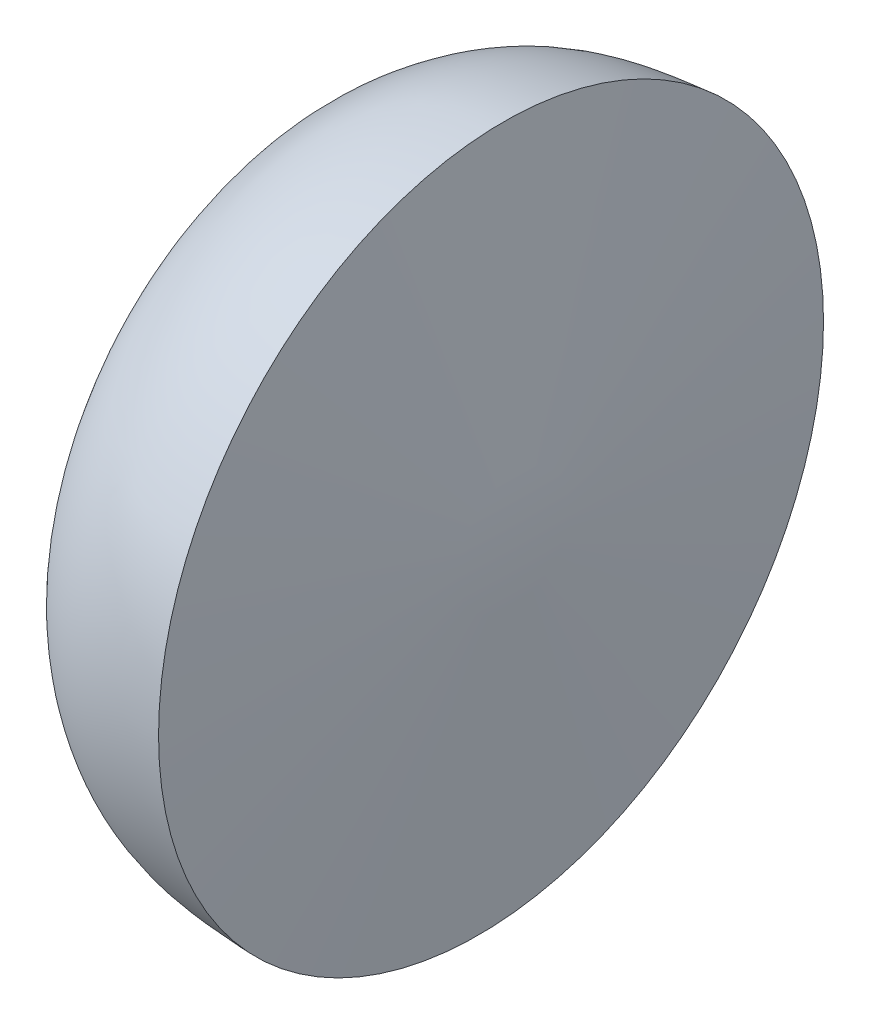
ISO-10303-21;
HEADER;
FILE_DESCRIPTION(('STEP AP214'),'2;1');
FILE_NAME('part.step','',(''),(''),'','','');
FILE_SCHEMA(('AUTOMOTIVE_DESIGN { 1 0 10303 214 1 1 1 1 }'));
ENDSEC;
DATA;
#1=APPLICATION_CONTEXT('core data for automotive mechanical design processes');
#2=APPLICATION_PROTOCOL_DEFINITION('international standard','automotive_design',2000,#1);
#3=PRODUCT_CONTEXT('',#1,'mechanical');
#4=PRODUCT('Part','Part','',(#3));
#5=PRODUCT_RELATED_PRODUCT_CATEGORY('part','',(#4));
#6=PRODUCT_DEFINITION_FORMATION('','',#4);
#7=PRODUCT_DEFINITION_CONTEXT('part definition',#1,'design');
#8=PRODUCT_DEFINITION('design','',#6,#7);
#9=PRODUCT_DEFINITION_SHAPE('','',#8);
#10=(LENGTH_UNIT() NAMED_UNIT(*) SI_UNIT(.MILLI.,.METRE.));
#11=(NAMED_UNIT(*) PLANE_ANGLE_UNIT() SI_UNIT($,.RADIAN.));
#12=(NAMED_UNIT(*) SI_UNIT($,.STERADIAN.) SOLID_ANGLE_UNIT());
#13=UNCERTAINTY_MEASURE_WITH_UNIT(LENGTH_MEASURE(1.E-05),#10,'distance_accuracy_value','');
#14=(GEOMETRIC_REPRESENTATION_CONTEXT(3) GLOBAL_UNCERTAINTY_ASSIGNED_CONTEXT((#13)) GLOBAL_UNIT_ASSIGNED_CONTEXT((#10,
#11,#12)) REPRESENTATION_CONTEXT('',''));
#15=CARTESIAN_POINT('',(0.,0.,0.));
#16=DIRECTION('',(0.,0.,1.));
#17=DIRECTION('',(1.,0.,0.));
#18=AXIS2_PLACEMENT_3D('',#15,#16,#17);
#19=CARTESIAN_POINT('',(20.4307514759363,0.110210275202592,-84.0362636047927));
#20=CARTESIAN_POINT('',(16.9591022779208,0.110210275202592,-83.6446114761183));
#21=CARTESIAN_POINT('',(10.8126899103328,0.110210275202592,-82.9825579256566));
#22=CARTESIAN_POINT('',(1.89081818748944,0.110210275202592,-81.1358672415944));
#23=CARTESIAN_POINT('',(-6.07682675292566,0.110210275202592,-78.0899910017187));
#24=CARTESIAN_POINT('',(-13.7568688696584,0.110210275202592,-73.0628965081617));
#25=CARTESIAN_POINT('',(-21.1147038140948,0.110210275202592,-65.9932410160981));
#26=CARTESIAN_POINT('',(-26.3178671037761,0.110210275202592,-56.0862436263187));
#27=CARTESIAN_POINT('',(-31.5892336308581,0.110210275202592,-46.5665217577918));
#28=CARTESIAN_POINT('',(-37.0860158206487,0.110210275202592,-35.0613816770689));
#29=CARTESIAN_POINT('',(-41.0680962118658,0.110210275202592,-27.1696413200161));
#30=CARTESIAN_POINT('',(-43.1829269558726,0.110210275202592,-21.8503264826861));
#31=B_SPLINE_CURVE_WITH_KNOTS('',3,(#19,#20,#21,#22,#23,#24,#25,#26,#27,#28,#29,#30),
.UNSPECIFIED.,.F.,.F.,(4,1,1,1,1,1,1,1,1,4),(0.,0.109958637691602,0.192943219858475,
0.285154888596976,0.375182429120895,0.479254840563815,0.600735182165393,0.722942180849383,
0.820915443266912,1.),.UNSPECIFIED.);
#32=CARTESIAN_POINT('',(-147.553734062644,0.110210275202592,6.15257166178141));
#33=DIRECTION('',(-0.999301060005245,0.,0.0373816996991039));
#34=AXIS1_PLACEMENT('',#32,#33);
#35=SURFACE_OF_REVOLUTION('',#31,#34);
#36=CARTESIAN_POINT('',(-42.2827095500906,0.110210275202592,2.2146094371395));
#37=DIRECTION('',(-0.999301060005245,0.,0.0373816996991039));
#38=DIRECTION('',(0.0373816996991039,0.,0.999301060005245));
#39=AXIS2_PLACEMENT_3D('',#36,#37,#38);
#40=CIRCLE('',#39,24.0817676303669);
#41=CARTESIAN_POINT('',(-41.3824921443086,0.110210275202592,26.2795453569651));
#42=VERTEX_POINT('',#41);
#43=EDGE_CURVE('E13',#42,#42,#40,.T.);
#44=ORIENTED_EDGE('',*,*,#43,.F.);
#45=EDGE_LOOP('',(#44));
#46=FACE_BOUND('',#45,.T.);
#47=CARTESIAN_POINT('',(23.5650669298423,0.110210275202592,-0.248614014473421));
#48=DIRECTION('',(-0.999301060005245,0.,0.0373816996991039));
#49=DIRECTION('',(0.0373816996991039,0.,0.999301060005245));
#50=AXIS2_PLACEMENT_3D('',#47,#48,#49);
#51=CIRCLE('',#50,83.8462530900143);
#52=CARTESIAN_POINT('',(26.6993823837483,0.110210275202592,83.5390355758459));
#53=VERTEX_POINT('',#52);
#54=EDGE_CURVE('E55',#53,#53,#51,.T.);
#55=ORIENTED_EDGE('',*,*,#54,.T.);
#56=EDGE_LOOP('',(#55));
#57=FACE_BOUND('',#56,.T.);
#58=ADVANCED_FACE('F47',(#46,#57),#35,.T.);
#59=CARTESIAN_POINT('',(-42.2827095500906,0.110210275202592,2.2146094371395));
#60=DIRECTION('',(0.999301060005245,0.,-0.0373816996991039));
#61=DIRECTION('',(-0.0373816996991039,0.,-0.999301060005245));
#62=AXIS2_PLACEMENT_3D('',#59,#60,#61);
#63=CONICAL_SURFACE('',#62,24.0817676303669,1.53340591547185);
#64=CARTESIAN_POINT('',(-43.1829269558726,0.110210275202592,2.248284630806));
#65=VERTEX_POINT('',#64);
#66=VERTEX_LOOP('',#65);
#67=FACE_BOUND('',#66,.T.);
#68=ORIENTED_EDGE('',*,*,#43,.T.);
#69=EDGE_LOOP('',(#68));
#70=FACE_BOUND('',#69,.T.);
#71=ADVANCED_FACE('F61',(#67,#70),#63,.T.);
#72=CARTESIAN_POINT('',(29.8566560664917,0.110210275202592,-0.483968809088701));
#73=DIRECTION('',(-0.999301060005245,0.,0.0373816996991039));
#74=DIRECTION('',(0.0373816996991039,0.,0.999301060005245));
#75=AXIS2_PLACEMENT_3D('',#72,#73,#74);
#76=CONICAL_SURFACE('',#75,0.,1.49584728539462);
#77=ORIENTED_EDGE('',*,*,#54,.F.);
#78=EDGE_LOOP('',(#77));
#79=FACE_BOUND('',#78,.T.);
#80=CARTESIAN_POINT('',(29.8566560664917,0.110210275202592,-0.483968809088701));
#81=VERTEX_POINT('',#80);
#82=VERTEX_LOOP('',#81);
#83=FACE_BOUND('',#82,.T.);
#84=ADVANCED_FACE('F64',(#79,#83),#76,.T.);
#85=CLOSED_SHELL('',(#58,#71,#84));
#86=MANIFOLD_SOLID_BREP('B2',#85);
#87=ADVANCED_BREP_SHAPE_REPRESENTATION('',(#18,#86),#14);
#88=SHAPE_DEFINITION_REPRESENTATION(#9,#87);
ENDSEC;
END-ISO-10303-21;
